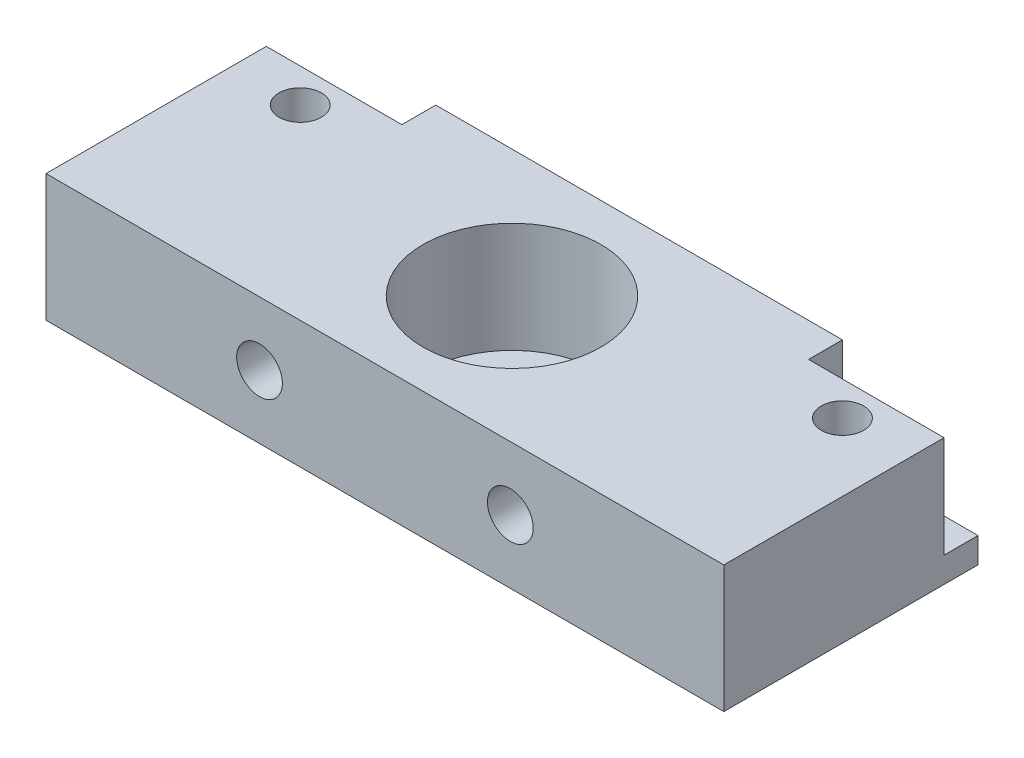
ISO-10303-21;
HEADER;
FILE_DESCRIPTION(('STEP AP214'),'2;1');
FILE_NAME('part.step','',(''),(''),'','','');
FILE_SCHEMA(('AUTOMOTIVE_DESIGN { 1 0 10303 214 1 1 1 1 }'));
ENDSEC;
DATA;
#1=APPLICATION_CONTEXT('core data for automotive mechanical design processes');
#2=APPLICATION_PROTOCOL_DEFINITION('international standard','automotive_design',2000,#1);
#3=PRODUCT_CONTEXT('',#1,'mechanical');
#4=PRODUCT('Part','Part','',(#3));
#5=PRODUCT_RELATED_PRODUCT_CATEGORY('part','',(#4));
#6=PRODUCT_DEFINITION_FORMATION('','',#4);
#7=PRODUCT_DEFINITION_CONTEXT('part definition',#1,'design');
#8=PRODUCT_DEFINITION('design','',#6,#7);
#9=PRODUCT_DEFINITION_SHAPE('','',#8);
#10=(LENGTH_UNIT() NAMED_UNIT(*) SI_UNIT(.MILLI.,.METRE.));
#11=(NAMED_UNIT(*) PLANE_ANGLE_UNIT() SI_UNIT($,.RADIAN.));
#12=(NAMED_UNIT(*) SI_UNIT($,.STERADIAN.) SOLID_ANGLE_UNIT());
#13=UNCERTAINTY_MEASURE_WITH_UNIT(LENGTH_MEASURE(1.E-05),#10,'distance_accuracy_value','');
#14=(GEOMETRIC_REPRESENTATION_CONTEXT(3) GLOBAL_UNCERTAINTY_ASSIGNED_CONTEXT((#13)) GLOBAL_UNIT_ASSIGNED_CONTEXT((#10,
#11,#12)) REPRESENTATION_CONTEXT('',''));
#15=CARTESIAN_POINT('',(0.,0.,0.));
#16=DIRECTION('',(0.,0.,1.));
#17=DIRECTION('',(1.,0.,0.));
#18=AXIS2_PLACEMENT_3D('',#15,#16,#17);
#19=CARTESIAN_POINT('',(-37.881508627531,19.05,-10.7765560165975));
#20=DIRECTION('',(1.,0.,0.));
#21=DIRECTION('',(0.,0.,-1.));
#22=AXIS2_PLACEMENT_3D('',#19,#20,#21);
#23=PLANE('',#22);
#24=DIRECTION('',(0.,0.,1.));
#25=VECTOR('',#24,1.);
#26=CARTESIAN_POINT('',(-37.881508627531,19.05,-10.7765560165975));
#27=LINE('',#26,#25);
#28=CARTESIAN_POINT('',(-37.881508627531,19.05,-5.6965560165975));
#29=VERTEX_POINT('',#28);
#30=CARTESIAN_POINT('',(-37.881508627531,19.05,27.3234439834025));
#31=VERTEX_POINT('',#30);
#32=EDGE_CURVE('E147',#29,#31,#27,.T.);
#33=ORIENTED_EDGE('',*,*,#32,.F.);
#34=DIRECTION('',(0.,1.,0.));
#35=VECTOR('',#34,1.);
#36=CARTESIAN_POINT('',(-37.881508627531,3.81,-5.6965560165975));
#37=LINE('',#36,#35);
#38=CARTESIAN_POINT('',(-37.881508627531,3.81,-5.6965560165975));
#39=VERTEX_POINT('',#38);
#40=EDGE_CURVE('E56',#39,#29,#37,.T.);
#41=ORIENTED_EDGE('',*,*,#40,.F.);
#42=DIRECTION('',(0.,0.,1.));
#43=VECTOR('',#42,1.);
#44=CARTESIAN_POINT('',(-37.881508627531,3.81,-10.7765560165975));
#45=LINE('',#44,#43);
#46=CARTESIAN_POINT('',(-37.881508627531,3.81,-10.7765560165975));
#47=VERTEX_POINT('',#46);
#48=EDGE_CURVE('E210',#47,#39,#45,.T.);
#49=ORIENTED_EDGE('',*,*,#48,.F.);
#50=DIRECTION('',(0.,-1.,0.));
#51=VECTOR('',#50,1.);
#52=CARTESIAN_POINT('',(-37.881508627531,19.05,-10.7765560165975));
#53=LINE('',#52,#51);
#54=CARTESIAN_POINT('',(-37.881508627531,0.,-10.7765560165975));
#55=VERTEX_POINT('',#54);
#56=EDGE_CURVE('E139',#47,#55,#53,.T.);
#57=ORIENTED_EDGE('',*,*,#56,.T.);
#58=DIRECTION('',(0.,0.,1.));
#59=VECTOR('',#58,1.);
#60=CARTESIAN_POINT('',(-37.881508627531,0.,-10.7765560165975));
#61=LINE('',#60,#59);
#62=CARTESIAN_POINT('',(-37.881508627531,0.,27.3234439834025));
#63=VERTEX_POINT('',#62);
#64=EDGE_CURVE('E151',#55,#63,#61,.T.);
#65=ORIENTED_EDGE('',*,*,#64,.T.);
#66=DIRECTION('',(0.,-1.,0.));
#67=VECTOR('',#66,1.);
#68=CARTESIAN_POINT('',(-37.881508627531,19.05,27.3234439834025));
#69=LINE('',#68,#67);
#70=EDGE_CURVE('E11',#31,#63,#69,.T.);
#71=ORIENTED_EDGE('',*,*,#70,.F.);
#72=EDGE_LOOP('',(#33,#41,#49,#57,#65,#71));
#73=FACE_BOUND('',#72,.T.);
#74=ADVANCED_FACE('F33',(#73),#23,.F.);
#75=CARTESIAN_POINT('',(-37.881508627531,19.05,27.3234439834025));
#76=DIRECTION('',(0.,0.,-1.));
#77=DIRECTION('',(-1.,0.,0.));
#78=AXIS2_PLACEMENT_3D('',#75,#76,#77);
#79=PLANE('',#78);
#80=CARTESIAN_POINT('',(31.714491372469,9.525,27.3234439834025));
#81=DIRECTION('',(0.,0.,1.));
#82=DIRECTION('',(1.,0.,0.));
#83=AXIS2_PLACEMENT_3D('',#80,#81,#82);
#84=CIRCLE('',#83,3.429);
#85=CARTESIAN_POINT('',(35.143491372469,9.525,27.3234439834025));
#86=VERTEX_POINT('',#85);
#87=EDGE_CURVE('E182',#86,#86,#84,.T.);
#88=ORIENTED_EDGE('',*,*,#87,.F.);
#89=EDGE_LOOP('',(#88));
#90=FACE_BOUND('',#89,.T.);
#91=CARTESIAN_POINT('',(-5.87750862753101,9.525,27.3234439834025));
#92=DIRECTION('',(0.,0.,1.));
#93=DIRECTION('',(1.,0.,0.));
#94=AXIS2_PLACEMENT_3D('',#91,#92,#93);
#95=CIRCLE('',#94,3.429);
#96=CARTESIAN_POINT('',(-2.44850862753101,9.525,27.3234439834025));
#97=VERTEX_POINT('',#96);
#98=EDGE_CURVE('E176',#97,#97,#95,.T.);
#99=ORIENTED_EDGE('',*,*,#98,.F.);
#100=EDGE_LOOP('',(#99));
#101=FACE_BOUND('',#100,.T.);
#102=DIRECTION('',(1.,0.,0.));
#103=VECTOR('',#102,1.);
#104=CARTESIAN_POINT('',(-37.881508627531,0.,27.3234439834025));
#105=LINE('',#104,#103);
#106=CARTESIAN_POINT('',(63.718491372469,0.,27.3234439834025));
#107=VERTEX_POINT('',#106);
#108=EDGE_CURVE('E149',#63,#107,#105,.T.);
#109=ORIENTED_EDGE('',*,*,#108,.T.);
#110=DIRECTION('',(0.,-1.,0.));
#111=VECTOR('',#110,1.);
#112=CARTESIAN_POINT('',(63.718491372469,19.05,27.3234439834025));
#113=LINE('',#112,#111);
#114=CARTESIAN_POINT('',(63.718491372469,19.05,27.3234439834025));
#115=VERTEX_POINT('',#114);
#116=EDGE_CURVE('E41',#115,#107,#113,.T.);
#117=ORIENTED_EDGE('',*,*,#116,.F.);
#118=DIRECTION('',(1.,0.,0.));
#119=VECTOR('',#118,1.);
#120=CARTESIAN_POINT('',(-37.881508627531,19.05,27.3234439834025));
#121=LINE('',#120,#119);
#122=EDGE_CURVE('E159',#31,#115,#121,.T.);
#123=ORIENTED_EDGE('',*,*,#122,.F.);
#124=ORIENTED_EDGE('',*,*,#70,.T.);
#125=EDGE_LOOP('',(#109,#117,#123,#124));
#126=FACE_BOUND('',#125,.T.);
#127=ADVANCED_FACE('F236',(#90,#101,#126),#79,.F.);
#128=CARTESIAN_POINT('',(63.718491372469,19.05,-10.7765560165975));
#129=DIRECTION('',(-1.,0.,0.));
#130=DIRECTION('',(0.,0.,1.));
#131=AXIS2_PLACEMENT_3D('',#128,#129,#130);
#132=PLANE('',#131);
#133=DIRECTION('',(0.,0.,-1.));
#134=VECTOR('',#133,1.);
#135=CARTESIAN_POINT('',(63.718491372469,3.81,-10.7765560165975));
#136=LINE('',#135,#134);
#137=CARTESIAN_POINT('',(63.718491372469,3.81,-5.6965560165975));
#138=VERTEX_POINT('',#137);
#139=CARTESIAN_POINT('',(63.718491372469,3.81,-10.7765560165975));
#140=VERTEX_POINT('',#139);
#141=EDGE_CURVE('E114',#138,#140,#136,.T.);
#142=ORIENTED_EDGE('',*,*,#141,.F.);
#143=DIRECTION('',(0.,1.,0.));
#144=VECTOR('',#143,1.);
#145=CARTESIAN_POINT('',(63.718491372469,3.81,-5.6965560165975));
#146=LINE('',#145,#144);
#147=CARTESIAN_POINT('',(63.718491372469,19.05,-5.6965560165975));
#148=VERTEX_POINT('',#147);
#149=EDGE_CURVE('E207',#138,#148,#146,.T.);
#150=ORIENTED_EDGE('',*,*,#149,.T.);
#151=DIRECTION('',(0.,0.,-1.));
#152=VECTOR('',#151,1.);
#153=CARTESIAN_POINT('',(63.718491372469,19.05,-10.7765560165975));
#154=LINE('',#153,#152);
#155=EDGE_CURVE('E156',#115,#148,#154,.T.);
#156=ORIENTED_EDGE('',*,*,#155,.F.);
#157=ORIENTED_EDGE('',*,*,#116,.T.);
#158=DIRECTION('',(0.,0.,-1.));
#159=VECTOR('',#158,1.);
#160=CARTESIAN_POINT('',(63.718491372469,0.,-10.7765560165975));
#161=LINE('',#160,#159);
#162=CARTESIAN_POINT('',(63.718491372469,0.,-10.7765560165975));
#163=VERTEX_POINT('',#162);
#164=EDGE_CURVE('E137',#107,#163,#161,.T.);
#165=ORIENTED_EDGE('',*,*,#164,.T.);
#166=DIRECTION('',(0.,-1.,0.));
#167=VECTOR('',#166,1.);
#168=CARTESIAN_POINT('',(63.718491372469,19.05,-10.7765560165975));
#169=LINE('',#168,#167);
#170=EDGE_CURVE('E130',#140,#163,#169,.T.);
#171=ORIENTED_EDGE('',*,*,#170,.F.);
#172=EDGE_LOOP('',(#142,#150,#156,#157,#165,#171));
#173=FACE_BOUND('',#172,.T.);
#174=ADVANCED_FACE('F134',(#173),#132,.F.);
#175=CARTESIAN_POINT('',(-37.881508627531,19.05,-10.7765560165975));
#176=DIRECTION('',(0.,0.,1.));
#177=DIRECTION('',(1.,0.,0.));
#178=AXIS2_PLACEMENT_3D('',#175,#176,#177);
#179=PLANE('',#178);
#180=CARTESIAN_POINT('',(31.714491372469,9.525,-10.7765560165975));
#181=DIRECTION('',(0.,0.,1.));
#182=DIRECTION('',(1.,0.,0.));
#183=AXIS2_PLACEMENT_3D('',#180,#181,#182);
#184=CIRCLE('',#183,3.429);
#185=CARTESIAN_POINT('',(35.143491372469,9.525,-10.7765560165975));
#186=VERTEX_POINT('',#185);
#187=EDGE_CURVE('E179',#186,#186,#184,.F.);
#188=ORIENTED_EDGE('',*,*,#187,.F.);
#189=EDGE_LOOP('',(#188));
#190=FACE_BOUND('',#189,.T.);
#191=CARTESIAN_POINT('',(-5.87750862753101,9.525,-10.7765560165975));
#192=DIRECTION('',(0.,0.,1.));
#193=DIRECTION('',(1.,0.,0.));
#194=AXIS2_PLACEMENT_3D('',#191,#192,#193);
#195=CIRCLE('',#194,3.429);
#196=CARTESIAN_POINT('',(-2.44850862753101,9.525,-10.7765560165975));
#197=VERTEX_POINT('',#196);
#198=EDGE_CURVE('E171',#197,#197,#195,.F.);
#199=ORIENTED_EDGE('',*,*,#198,.F.);
#200=EDGE_LOOP('',(#199));
#201=FACE_BOUND('',#200,.T.);
#202=DIRECTION('',(-1.,0.,0.));
#203=VECTOR('',#202,1.);
#204=CARTESIAN_POINT('',(-37.881508627531,19.05,-10.7765560165975));
#205=LINE('',#204,#203);
#206=CARTESIAN_POINT('',(43.398491372469,19.05,-10.7765560165975));
#207=VERTEX_POINT('',#206);
#208=CARTESIAN_POINT('',(-17.561508627531,19.05,-10.7765560165975));
#209=VERTEX_POINT('',#208);
#210=EDGE_CURVE('E142',#207,#209,#205,.T.);
#211=ORIENTED_EDGE('',*,*,#210,.F.);
#212=DIRECTION('',(0.,1.,0.));
#213=VECTOR('',#212,1.);
#214=CARTESIAN_POINT('',(43.398491372469,3.81,-10.7765560165975));
#215=LINE('',#214,#213);
#216=CARTESIAN_POINT('',(43.398491372469,3.81,-10.7765560165975));
#217=VERTEX_POINT('',#216);
#218=EDGE_CURVE('E48',#217,#207,#215,.T.);
#219=ORIENTED_EDGE('',*,*,#218,.F.);
#220=DIRECTION('',(-1.,0.,0.));
#221=VECTOR('',#220,1.);
#222=CARTESIAN_POINT('',(63.718491372469,3.81,-10.7765560165975));
#223=LINE('',#222,#221);
#224=EDGE_CURVE('E118',#140,#217,#223,.T.);
#225=ORIENTED_EDGE('',*,*,#224,.F.);
#226=ORIENTED_EDGE('',*,*,#170,.T.);
#227=DIRECTION('',(-1.,0.,0.));
#228=VECTOR('',#227,1.);
#229=CARTESIAN_POINT('',(-37.881508627531,0.,-10.7765560165975));
#230=LINE('',#229,#228);
#231=EDGE_CURVE('E145',#163,#55,#230,.T.);
#232=ORIENTED_EDGE('',*,*,#231,.T.);
#233=ORIENTED_EDGE('',*,*,#56,.F.);
#234=DIRECTION('',(-1.,0.,0.));
#235=VECTOR('',#234,1.);
#236=CARTESIAN_POINT('',(-17.561508627531,3.81,-10.7765560165975));
#237=LINE('',#236,#235);
#238=CARTESIAN_POINT('',(-17.561508627531,3.81,-10.7765560165975));
#239=VERTEX_POINT('',#238);
#240=EDGE_CURVE('E212',#239,#47,#237,.T.);
#241=ORIENTED_EDGE('',*,*,#240,.F.);
#242=DIRECTION('',(0.,1.,0.));
#243=VECTOR('',#242,1.);
#244=CARTESIAN_POINT('',(-17.561508627531,3.81,-10.7765560165975));
#245=LINE('',#244,#243);
#246=EDGE_CURVE('E195',#239,#209,#245,.T.);
#247=ORIENTED_EDGE('',*,*,#246,.T.);
#248=EDGE_LOOP('',(#211,#219,#225,#226,#232,#233,#241,#247));
#249=FACE_BOUND('',#248,.T.);
#250=ADVANCED_FACE('F128',(#190,#201,#249),#179,.F.);
#251=CARTESIAN_POINT('',(0.,19.05,0.));
#252=DIRECTION('',(0.,1.,0.));
#253=DIRECTION('',(0.,0.,1.));
#254=AXIS2_PLACEMENT_3D('',#251,#252,#253);
#255=PLANE('',#254);
#256=DIRECTION('',(1.,0.,0.));
#257=VECTOR('',#256,1.);
#258=CARTESIAN_POINT('',(63.718491372469,19.05,-5.6965560165975));
#259=LINE('',#258,#257);
#260=CARTESIAN_POINT('',(43.398491372469,19.05,-5.6965560165975));
#261=VERTEX_POINT('',#260);
#262=EDGE_CURVE('E124',#261,#148,#259,.T.);
#263=ORIENTED_EDGE('',*,*,#262,.F.);
#264=DIRECTION('',(0.,0.,1.));
#265=VECTOR('',#264,1.);
#266=CARTESIAN_POINT('',(43.398491372469,19.05,-10.7765560165975));
#267=LINE('',#266,#265);
#268=EDGE_CURVE('E221',#207,#261,#267,.T.);
#269=ORIENTED_EDGE('',*,*,#268,.F.);
#270=ORIENTED_EDGE('',*,*,#210,.T.);
#271=DIRECTION('',(0.,0.,-1.));
#272=VECTOR('',#271,1.);
#273=CARTESIAN_POINT('',(-17.561508627531,19.05,-10.7765560165975));
#274=LINE('',#273,#272);
#275=CARTESIAN_POINT('',(-17.561508627531,19.05,-5.6965560165975));
#276=VERTEX_POINT('',#275);
#277=EDGE_CURVE('E204',#276,#209,#274,.T.);
#278=ORIENTED_EDGE('',*,*,#277,.F.);
#279=DIRECTION('',(1.,0.,0.));
#280=VECTOR('',#279,1.);
#281=CARTESIAN_POINT('',(-17.561508627531,19.05,-5.6965560165975));
#282=LINE('',#281,#280);
#283=EDGE_CURVE('E201',#29,#276,#282,.T.);
#284=ORIENTED_EDGE('',*,*,#283,.F.);
#285=ORIENTED_EDGE('',*,*,#32,.T.);
#286=ORIENTED_EDGE('',*,*,#122,.T.);
#287=ORIENTED_EDGE('',*,*,#155,.T.);
#288=EDGE_LOOP('',(#263,#269,#270,#278,#284,#285,#286,#287));
#289=FACE_BOUND('',#288,.T.);
#290=CARTESIAN_POINT('',(12.918491372469,19.05,8.2734439834025));
#291=DIRECTION('',(0.,1.,0.));
#292=DIRECTION('',(0.,0.,1.));
#293=AXIS2_PLACEMENT_3D('',#290,#291,#292);
#294=CIRCLE('',#293,13.335);
#295=CARTESIAN_POINT('',(12.918491372469,19.05,21.6084439834025));
#296=VERTEX_POINT('',#295);
#297=EDGE_CURVE('E186',#296,#296,#294,.T.);
#298=ORIENTED_EDGE('',*,*,#297,.F.);
#299=EDGE_LOOP('',(#298));
#300=FACE_BOUND('',#299,.T.);
#301=CARTESIAN_POINT('',(53.558491372469,19.05,-0.616556016597498));
#302=DIRECTION('',(0.,1.,0.));
#303=DIRECTION('',(0.,0.,1.));
#304=AXIS2_PLACEMENT_3D('',#301,#302,#303);
#305=CIRCLE('',#304,3.175);
#306=CARTESIAN_POINT('',(53.558491372469,19.05,2.5584439834025));
#307=VERTEX_POINT('',#306);
#308=EDGE_CURVE('E168',#307,#307,#305,.T.);
#309=ORIENTED_EDGE('',*,*,#308,.F.);
#310=EDGE_LOOP('',(#309));
#311=FACE_BOUND('',#310,.T.);
#312=CARTESIAN_POINT('',(-27.721508627531,19.05,-0.6165560165975));
#313=DIRECTION('',(0.,1.,0.));
#314=DIRECTION('',(0.,0.,1.));
#315=AXIS2_PLACEMENT_3D('',#312,#313,#314);
#316=CIRCLE('',#315,3.175);
#317=CARTESIAN_POINT('',(-27.721508627531,19.05,2.5584439834025));
#318=VERTEX_POINT('',#317);
#319=EDGE_CURVE('E162',#318,#318,#316,.T.);
#320=ORIENTED_EDGE('',*,*,#319,.F.);
#321=EDGE_LOOP('',(#320));
#322=FACE_BOUND('',#321,.T.);
#323=ADVANCED_FACE('F229',(#289,#300,#311,#322),#255,.T.);
#324=CARTESIAN_POINT('',(0.,0.,0.));
#325=DIRECTION('',(0.,1.,0.));
#326=DIRECTION('',(0.,0.,1.));
#327=AXIS2_PLACEMENT_3D('',#324,#325,#326);
#328=PLANE('',#327);
#329=CARTESIAN_POINT('',(12.918491372469,0.,8.2734439834025));
#330=DIRECTION('',(0.,1.,0.));
#331=DIRECTION('',(0.,0.,1.));
#332=AXIS2_PLACEMENT_3D('',#329,#330,#331);
#333=CIRCLE('',#332,3.556);
#334=CARTESIAN_POINT('',(12.918491372469,0.,11.8294439834025));
#335=VERTEX_POINT('',#334);
#336=EDGE_CURVE('E191',#335,#335,#333,.T.);
#337=ORIENTED_EDGE('',*,*,#336,.T.);
#338=EDGE_LOOP('',(#337));
#339=FACE_BOUND('',#338,.T.);
#340=ORIENTED_EDGE('',*,*,#64,.F.);
#341=ORIENTED_EDGE('',*,*,#231,.F.);
#342=ORIENTED_EDGE('',*,*,#164,.F.);
#343=ORIENTED_EDGE('',*,*,#108,.F.);
#344=EDGE_LOOP('',(#340,#341,#342,#343));
#345=FACE_BOUND('',#344,.T.);
#346=ADVANCED_FACE('F239',(#339,#345),#328,.F.);
#347=CARTESIAN_POINT('',(-27.721508627531,2.54,-0.6165560165975));
#348=DIRECTION('',(0.,1.,0.));
#349=DIRECTION('',(0.,0.,1.));
#350=AXIS2_PLACEMENT_3D('',#347,#348,#349);
#351=CYLINDRICAL_SURFACE('',#350,3.175);
#352=CARTESIAN_POINT('',(-27.721508627531,2.54,-0.6165560165975));
#353=DIRECTION('',(0.,1.,0.));
#354=DIRECTION('',(0.,0.,1.));
#355=AXIS2_PLACEMENT_3D('',#352,#353,#354);
#356=CIRCLE('',#355,3.175);
#357=CARTESIAN_POINT('',(-27.721508627531,2.54,2.5584439834025));
#358=VERTEX_POINT('',#357);
#359=EDGE_CURVE('E154',#358,#358,#356,.T.);
#360=ORIENTED_EDGE('',*,*,#359,.F.);
#361=EDGE_LOOP('',(#360));
#362=FACE_BOUND('',#361,.T.);
#363=ORIENTED_EDGE('',*,*,#319,.T.);
#364=EDGE_LOOP('',(#363));
#365=FACE_BOUND('',#364,.T.);
#366=ADVANCED_FACE('F278',(#362,#365),#351,.F.);
#367=CARTESIAN_POINT('',(-27.721508627531,2.54,-0.6165560165975));
#368=DIRECTION('',(0.,1.,0.));
#369=DIRECTION('',(0.,0.,1.));
#370=AXIS2_PLACEMENT_3D('',#367,#368,#369);
#371=PLANE('',#370);
#372=ORIENTED_EDGE('',*,*,#359,.T.);
#373=EDGE_LOOP('',(#372));
#374=FACE_BOUND('',#373,.T.);
#375=ADVANCED_FACE('F284',(#374),#371,.T.);
#376=CARTESIAN_POINT('',(53.558491372469,2.54,-0.616556016597498));
#377=DIRECTION('',(0.,1.,0.));
#378=DIRECTION('',(0.,0.,1.));
#379=AXIS2_PLACEMENT_3D('',#376,#377,#378);
#380=CYLINDRICAL_SURFACE('',#379,3.175);
#381=CARTESIAN_POINT('',(53.558491372469,2.54,-0.616556016597498));
#382=DIRECTION('',(0.,1.,0.));
#383=DIRECTION('',(0.,0.,1.));
#384=AXIS2_PLACEMENT_3D('',#381,#382,#383);
#385=CIRCLE('',#384,3.175);
#386=CARTESIAN_POINT('',(53.558491372469,2.54,2.5584439834025));
#387=VERTEX_POINT('',#386);
#388=EDGE_CURVE('E165',#387,#387,#385,.T.);
#389=ORIENTED_EDGE('',*,*,#388,.F.);
#390=EDGE_LOOP('',(#389));
#391=FACE_BOUND('',#390,.T.);
#392=ORIENTED_EDGE('',*,*,#308,.T.);
#393=EDGE_LOOP('',(#392));
#394=FACE_BOUND('',#393,.T.);
#395=ADVANCED_FACE('F288',(#391,#394),#380,.F.);
#396=CARTESIAN_POINT('',(53.558491372469,2.54,-0.616556016597498));
#397=DIRECTION('',(0.,1.,0.));
#398=DIRECTION('',(0.,0.,1.));
#399=AXIS2_PLACEMENT_3D('',#396,#397,#398);
#400=PLANE('',#399);
#401=ORIENTED_EDGE('',*,*,#388,.T.);
#402=EDGE_LOOP('',(#401));
#403=FACE_BOUND('',#402,.T.);
#404=ADVANCED_FACE('F292',(#403),#400,.T.);
#405=CARTESIAN_POINT('',(-5.87750862753101,9.525,-10.7775560165975));
#406=DIRECTION('',(0.,0.,1.));
#407=DIRECTION('',(1.,0.,0.));
#408=AXIS2_PLACEMENT_3D('',#405,#406,#407);
#409=CYLINDRICAL_SURFACE('',#408,3.429);
#410=ORIENTED_EDGE('',*,*,#98,.T.);
#411=EDGE_LOOP('',(#410));
#412=FACE_BOUND('',#411,.T.);
#413=ORIENTED_EDGE('',*,*,#198,.T.);
#414=EDGE_LOOP('',(#413));
#415=FACE_BOUND('',#414,.T.);
#416=ADVANCED_FACE('F296',(#412,#415),#409,.F.);
#417=CARTESIAN_POINT('',(31.714491372469,9.525,-10.7775560165975));
#418=DIRECTION('',(0.,0.,1.));
#419=DIRECTION('',(1.,0.,0.));
#420=AXIS2_PLACEMENT_3D('',#417,#418,#419);
#421=CYLINDRICAL_SURFACE('',#420,3.429);
#422=ORIENTED_EDGE('',*,*,#87,.T.);
#423=EDGE_LOOP('',(#422));
#424=FACE_BOUND('',#423,.T.);
#425=ORIENTED_EDGE('',*,*,#187,.T.);
#426=EDGE_LOOP('',(#425));
#427=FACE_BOUND('',#426,.T.);
#428=ADVANCED_FACE('F300',(#424,#427),#421,.F.);
#429=CARTESIAN_POINT('',(12.918491372469,2.54,8.2734439834025));
#430=DIRECTION('',(0.,1.,0.));
#431=DIRECTION('',(0.,0.,1.));
#432=AXIS2_PLACEMENT_3D('',#429,#430,#431);
#433=CYLINDRICAL_SURFACE('',#432,13.335);
#434=CARTESIAN_POINT('',(12.918491372469,2.54,8.2734439834025));
#435=DIRECTION('',(0.,1.,0.));
#436=DIRECTION('',(0.,0.,1.));
#437=AXIS2_PLACEMENT_3D('',#434,#435,#436);
#438=CIRCLE('',#437,13.335);
#439=CARTESIAN_POINT('',(12.918491372469,2.54,21.6084439834025));
#440=VERTEX_POINT('',#439);
#441=EDGE_CURVE('E185',#440,#440,#438,.T.);
#442=ORIENTED_EDGE('',*,*,#441,.F.);
#443=EDGE_LOOP('',(#442));
#444=FACE_BOUND('',#443,.T.);
#445=ORIENTED_EDGE('',*,*,#297,.T.);
#446=EDGE_LOOP('',(#445));
#447=FACE_BOUND('',#446,.T.);
#448=ADVANCED_FACE('F304',(#444,#447),#433,.F.);
#449=CARTESIAN_POINT('',(12.918491372469,2.54,8.2734439834025));
#450=DIRECTION('',(0.,1.,0.));
#451=DIRECTION('',(0.,0.,1.));
#452=AXIS2_PLACEMENT_3D('',#449,#450,#451);
#453=PLANE('',#452);
#454=CARTESIAN_POINT('',(12.918491372469,2.54,8.2734439834025));
#455=DIRECTION('',(0.,1.,0.));
#456=DIRECTION('',(0.,0.,1.));
#457=AXIS2_PLACEMENT_3D('',#454,#455,#456);
#458=CIRCLE('',#457,3.556);
#459=CARTESIAN_POINT('',(12.918491372469,2.54,11.8294439834025));
#460=VERTEX_POINT('',#459);
#461=EDGE_CURVE('E36',#460,#460,#458,.T.);
#462=ORIENTED_EDGE('',*,*,#461,.F.);
#463=EDGE_LOOP('',(#462));
#464=FACE_BOUND('',#463,.T.);
#465=ORIENTED_EDGE('',*,*,#441,.T.);
#466=EDGE_LOOP('',(#465));
#467=FACE_BOUND('',#466,.T.);
#468=ADVANCED_FACE('F308',(#464,#467),#453,.T.);
#469=CARTESIAN_POINT('',(12.918491372469,0.,8.2734439834025));
#470=DIRECTION('',(0.,1.,0.));
#471=DIRECTION('',(0.,0.,1.));
#472=AXIS2_PLACEMENT_3D('',#469,#470,#471);
#473=CYLINDRICAL_SURFACE('',#472,3.556);
#474=ORIENTED_EDGE('',*,*,#461,.T.);
#475=EDGE_LOOP('',(#474));
#476=FACE_BOUND('',#475,.T.);
#477=ORIENTED_EDGE('',*,*,#336,.F.);
#478=EDGE_LOOP('',(#477));
#479=FACE_BOUND('',#478,.T.);
#480=ADVANCED_FACE('F312',(#476,#479),#473,.F.);
#481=CARTESIAN_POINT('',(-17.561508627531,3.81,-10.7765560165975));
#482=DIRECTION('',(1.,0.,0.));
#483=DIRECTION('',(0.,0.,-1.));
#484=AXIS2_PLACEMENT_3D('',#481,#482,#483);
#485=PLANE('',#484);
#486=ORIENTED_EDGE('',*,*,#277,.T.);
#487=ORIENTED_EDGE('',*,*,#246,.F.);
#488=DIRECTION('',(0.,0.,-1.));
#489=VECTOR('',#488,1.);
#490=CARTESIAN_POINT('',(-17.561508627531,3.81,-10.7765560165975));
#491=LINE('',#490,#489);
#492=CARTESIAN_POINT('',(-17.561508627531,3.81,-5.6965560165975));
#493=VERTEX_POINT('',#492);
#494=EDGE_CURVE('E203',#493,#239,#491,.T.);
#495=ORIENTED_EDGE('',*,*,#494,.F.);
#496=DIRECTION('',(0.,1.,0.));
#497=VECTOR('',#496,1.);
#498=CARTESIAN_POINT('',(-17.561508627531,3.81,-5.6965560165975));
#499=LINE('',#498,#497);
#500=EDGE_CURVE('E194',#493,#276,#499,.T.);
#501=ORIENTED_EDGE('',*,*,#500,.T.);
#502=EDGE_LOOP('',(#486,#487,#495,#501));
#503=FACE_BOUND('',#502,.T.);
#504=ADVANCED_FACE('F250',(#503),#485,.F.);
#505=CARTESIAN_POINT('',(-17.561508627531,3.81,-5.6965560165975));
#506=DIRECTION('',(0.,0.,1.));
#507=DIRECTION('',(1.,0.,0.));
#508=AXIS2_PLACEMENT_3D('',#505,#506,#507);
#509=PLANE('',#508);
#510=ORIENTED_EDGE('',*,*,#283,.T.);
#511=ORIENTED_EDGE('',*,*,#500,.F.);
#512=DIRECTION('',(1.,0.,0.));
#513=VECTOR('',#512,1.);
#514=CARTESIAN_POINT('',(-17.561508627531,3.81,-5.6965560165975));
#515=LINE('',#514,#513);
#516=EDGE_CURVE('E198',#39,#493,#515,.T.);
#517=ORIENTED_EDGE('',*,*,#516,.F.);
#518=ORIENTED_EDGE('',*,*,#40,.T.);
#519=EDGE_LOOP('',(#510,#511,#517,#518));
#520=FACE_BOUND('',#519,.T.);
#521=ADVANCED_FACE('F246',(#520),#509,.F.);
#522=CARTESIAN_POINT('',(0.,3.81,0.));
#523=DIRECTION('',(0.,-1.,0.));
#524=DIRECTION('',(0.,0.,-1.));
#525=AXIS2_PLACEMENT_3D('',#522,#523,#524);
#526=PLANE('',#525);
#527=ORIENTED_EDGE('',*,*,#494,.T.);
#528=ORIENTED_EDGE('',*,*,#240,.T.);
#529=ORIENTED_EDGE('',*,*,#48,.T.);
#530=ORIENTED_EDGE('',*,*,#516,.T.);
#531=EDGE_LOOP('',(#527,#528,#529,#530));
#532=FACE_BOUND('',#531,.T.);
#533=ADVANCED_FACE('F245',(#532),#526,.F.);
#534=CARTESIAN_POINT('',(63.718491372469,3.81,-5.6965560165975));
#535=DIRECTION('',(0.,0.,1.));
#536=DIRECTION('',(1.,0.,0.));
#537=AXIS2_PLACEMENT_3D('',#534,#535,#536);
#538=PLANE('',#537);
#539=ORIENTED_EDGE('',*,*,#262,.T.);
#540=ORIENTED_EDGE('',*,*,#149,.F.);
#541=DIRECTION('',(1.,0.,0.));
#542=VECTOR('',#541,1.);
#543=CARTESIAN_POINT('',(63.718491372469,3.81,-5.6965560165975));
#544=LINE('',#543,#542);
#545=CARTESIAN_POINT('',(43.398491372469,3.81,-5.6965560165975));
#546=VERTEX_POINT('',#545);
#547=EDGE_CURVE('E120',#546,#138,#544,.T.);
#548=ORIENTED_EDGE('',*,*,#547,.F.);
#549=DIRECTION('',(0.,1.,0.));
#550=VECTOR('',#549,1.);
#551=CARTESIAN_POINT('',(43.398491372469,3.81,-5.6965560165975));
#552=LINE('',#551,#550);
#553=EDGE_CURVE('E217',#546,#261,#552,.T.);
#554=ORIENTED_EDGE('',*,*,#553,.T.);
#555=EDGE_LOOP('',(#539,#540,#548,#554));
#556=FACE_BOUND('',#555,.T.);
#557=ADVANCED_FACE('F225',(#556),#538,.F.);
#558=CARTESIAN_POINT('',(43.398491372469,3.81,-10.7765560165975));
#559=DIRECTION('',(-1.,0.,0.));
#560=DIRECTION('',(0.,0.,1.));
#561=AXIS2_PLACEMENT_3D('',#558,#559,#560);
#562=PLANE('',#561);
#563=ORIENTED_EDGE('',*,*,#268,.T.);
#564=ORIENTED_EDGE('',*,*,#553,.F.);
#565=DIRECTION('',(0.,0.,1.));
#566=VECTOR('',#565,1.);
#567=CARTESIAN_POINT('',(43.398491372469,3.81,-10.7765560165975));
#568=LINE('',#567,#566);
#569=EDGE_CURVE('E132',#217,#546,#568,.T.);
#570=ORIENTED_EDGE('',*,*,#569,.F.);
#571=ORIENTED_EDGE('',*,*,#218,.T.);
#572=EDGE_LOOP('',(#563,#564,#570,#571));
#573=FACE_BOUND('',#572,.T.);
#574=ADVANCED_FACE('F251',(#573),#562,.F.);
#575=CARTESIAN_POINT('',(0.,3.81,0.));
#576=DIRECTION('',(0.,-1.,0.));
#577=DIRECTION('',(0.,0.,-1.));
#578=AXIS2_PLACEMENT_3D('',#575,#576,#577);
#579=PLANE('',#578);
#580=ORIENTED_EDGE('',*,*,#141,.T.);
#581=ORIENTED_EDGE('',*,*,#224,.T.);
#582=ORIENTED_EDGE('',*,*,#569,.T.);
#583=ORIENTED_EDGE('',*,*,#547,.T.);
#584=EDGE_LOOP('',(#580,#581,#582,#583));
#585=FACE_BOUND('',#584,.T.);
#586=ADVANCED_FACE('F116',(#585),#579,.F.);
#587=CLOSED_SHELL('',(#74,#127,#174,#250,#323,#346,#366,#375,#395,#404,#416,#428,#448,#468,#480,
#504,#521,#533,#557,#574,#586));
#588=MANIFOLD_SOLID_BREP('B2',#587);
#589=ADVANCED_BREP_SHAPE_REPRESENTATION('',(#18,#588),#14);
#590=SHAPE_DEFINITION_REPRESENTATION(#9,#589);
ENDSEC;
END-ISO-10303-21;
